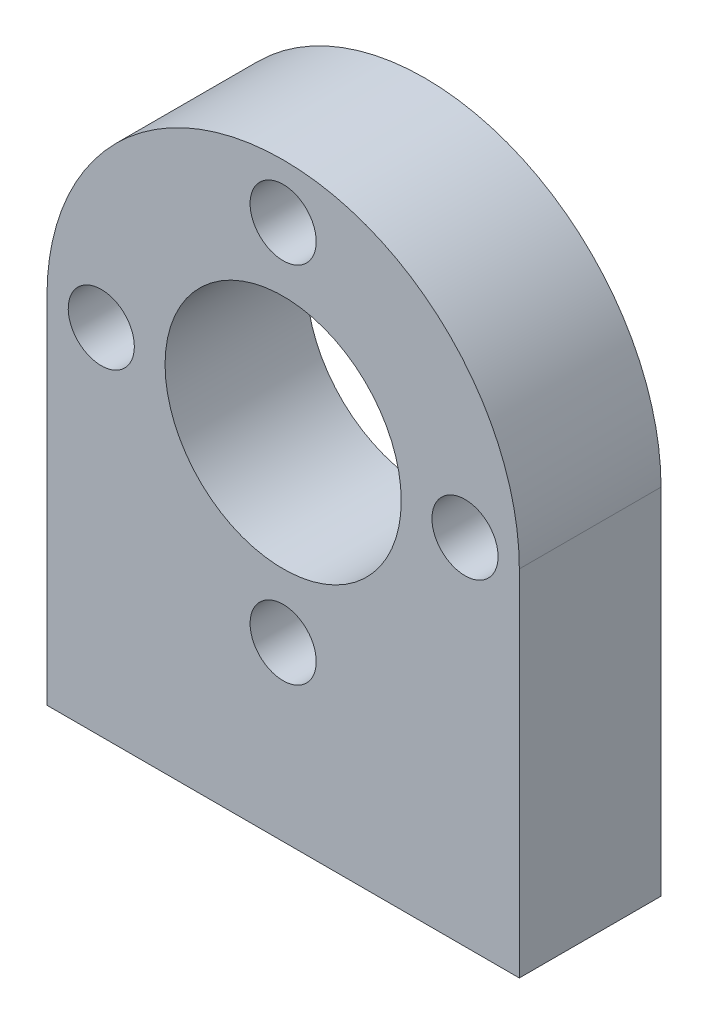
ISO-10303-21;
HEADER;
FILE_DESCRIPTION(('STEP AP214'),'2;1');
FILE_NAME('part.step','',(''),(''),'','','');
FILE_SCHEMA(('AUTOMOTIVE_DESIGN { 1 0 10303 214 1 1 1 1 }'));
ENDSEC;
DATA;
#1=APPLICATION_CONTEXT('core data for automotive mechanical design processes');
#2=APPLICATION_PROTOCOL_DEFINITION('international standard','automotive_design',2000,#1);
#3=PRODUCT_CONTEXT('',#1,'mechanical');
#4=PRODUCT('Part','Part','',(#3));
#5=PRODUCT_RELATED_PRODUCT_CATEGORY('part','',(#4));
#6=PRODUCT_DEFINITION_FORMATION('','',#4);
#7=PRODUCT_DEFINITION_CONTEXT('part definition',#1,'design');
#8=PRODUCT_DEFINITION('design','',#6,#7);
#9=PRODUCT_DEFINITION_SHAPE('','',#8);
#10=(LENGTH_UNIT() NAMED_UNIT(*) SI_UNIT(.MILLI.,.METRE.));
#11=(NAMED_UNIT(*) PLANE_ANGLE_UNIT() SI_UNIT($,.RADIAN.));
#12=(NAMED_UNIT(*) SI_UNIT($,.STERADIAN.) SOLID_ANGLE_UNIT());
#13=UNCERTAINTY_MEASURE_WITH_UNIT(LENGTH_MEASURE(1.E-05),#10,'distance_accuracy_value','');
#14=(GEOMETRIC_REPRESENTATION_CONTEXT(3) GLOBAL_UNCERTAINTY_ASSIGNED_CONTEXT((#13)) GLOBAL_UNIT_ASSIGNED_CONTEXT((#10,
#11,#12)) REPRESENTATION_CONTEXT('',''));
#15=CARTESIAN_POINT('',(0.,0.,0.));
#16=DIRECTION('',(0.,0.,1.));
#17=DIRECTION('',(1.,0.,0.));
#18=AXIS2_PLACEMENT_3D('',#15,#16,#17);
#19=CARTESIAN_POINT('',(0.,0.,7.62));
#20=DIRECTION('',(1.,0.,0.));
#21=DIRECTION('',(0.,0.,-1.));
#22=AXIS2_PLACEMENT_3D('',#19,#20,#21);
#23=PLANE('',#22);
#24=DIRECTION('',(0.,-1.,0.));
#25=VECTOR('',#24,1.);
#26=CARTESIAN_POINT('',(0.,0.,0.));
#27=LINE('',#26,#25);
#28=CARTESIAN_POINT('',(0.,-12.7,0.));
#29=VERTEX_POINT('',#28);
#30=CARTESIAN_POINT('',(0.,-31.75,0.));
#31=VERTEX_POINT('',#30);
#32=EDGE_CURVE('E98',#29,#31,#27,.T.);
#33=ORIENTED_EDGE('',*,*,#32,.F.);
#34=DIRECTION('',(0.,0.,-1.));
#35=VECTOR('',#34,1.);
#36=CARTESIAN_POINT('',(0.,-12.7,7.62));
#37=LINE('',#36,#35);
#38=CARTESIAN_POINT('',(0.,-12.7,7.62));
#39=VERTEX_POINT('',#38);
#40=EDGE_CURVE('E11',#39,#29,#37,.T.);
#41=ORIENTED_EDGE('',*,*,#40,.F.);
#42=DIRECTION('',(0.,-1.,0.));
#43=VECTOR('',#42,1.);
#44=CARTESIAN_POINT('',(0.,0.,7.62));
#45=LINE('',#44,#43);
#46=CARTESIAN_POINT('',(0.,-31.75,7.62));
#47=VERTEX_POINT('',#46);
#48=EDGE_CURVE('E83',#39,#47,#45,.T.);
#49=ORIENTED_EDGE('',*,*,#48,.T.);
#50=DIRECTION('',(0.,0.,-1.));
#51=VECTOR('',#50,1.);
#52=CARTESIAN_POINT('',(0.,-31.75,7.62));
#53=LINE('',#52,#51);
#54=EDGE_CURVE('E51',#47,#31,#53,.T.);
#55=ORIENTED_EDGE('',*,*,#54,.T.);
#56=EDGE_LOOP('',(#33,#41,#49,#55));
#57=FACE_BOUND('',#56,.T.);
#58=ADVANCED_FACE('F35',(#57),#23,.T.);
#59=CARTESIAN_POINT('',(-12.7,-12.7,7.62));
#60=DIRECTION('',(0.,0.,-1.));
#61=DIRECTION('',(-1.,0.,0.));
#62=AXIS2_PLACEMENT_3D('',#59,#60,#61);
#63=CYLINDRICAL_SURFACE('',#62,12.7);
#64=CARTESIAN_POINT('',(-12.7,-12.7,0.));
#65=DIRECTION('',(0.,0.,1.));
#66=DIRECTION('',(1.,0.,0.));
#67=AXIS2_PLACEMENT_3D('',#64,#65,#66);
#68=CIRCLE('',#67,12.7);
#69=CARTESIAN_POINT('',(-25.4,-12.7,0.));
#70=VERTEX_POINT('',#69);
#71=EDGE_CURVE('E89',#29,#70,#68,.T.);
#72=ORIENTED_EDGE('',*,*,#71,.T.);
#73=DIRECTION('',(0.,0.,-1.));
#74=VECTOR('',#73,1.);
#75=CARTESIAN_POINT('',(-25.4,-12.7,7.62));
#76=LINE('',#75,#74);
#77=CARTESIAN_POINT('',(-25.4,-12.7,7.62));
#78=VERTEX_POINT('',#77);
#79=EDGE_CURVE('E43',#78,#70,#76,.T.);
#80=ORIENTED_EDGE('',*,*,#79,.F.);
#81=CARTESIAN_POINT('',(-12.7,-12.7,7.62));
#82=DIRECTION('',(0.,0.,1.));
#83=DIRECTION('',(1.,0.,0.));
#84=AXIS2_PLACEMENT_3D('',#81,#82,#83);
#85=CIRCLE('',#84,12.7);
#86=EDGE_CURVE('E77',#39,#78,#85,.T.);
#87=ORIENTED_EDGE('',*,*,#86,.F.);
#88=ORIENTED_EDGE('',*,*,#40,.T.);
#89=EDGE_LOOP('',(#72,#80,#87,#88));
#90=FACE_BOUND('',#89,.T.);
#91=ADVANCED_FACE('F87',(#90),#63,.T.);
#92=CARTESIAN_POINT('',(-25.4,0.,7.62));
#93=DIRECTION('',(1.,0.,0.));
#94=DIRECTION('',(0.,1.,0.));
#95=AXIS2_PLACEMENT_3D('',#92,#93,#94);
#96=PLANE('',#95);
#97=DIRECTION('',(0.,-1.,0.));
#98=VECTOR('',#97,1.);
#99=CARTESIAN_POINT('',(-25.4,0.,0.));
#100=LINE('',#99,#98);
#101=CARTESIAN_POINT('',(-25.4,-31.75,0.));
#102=VERTEX_POINT('',#101);
#103=EDGE_CURVE('E102',#70,#102,#100,.T.);
#104=ORIENTED_EDGE('',*,*,#103,.T.);
#105=DIRECTION('',(0.,0.,-1.));
#106=VECTOR('',#105,1.);
#107=CARTESIAN_POINT('',(-25.4,-31.75,7.62));
#108=LINE('',#107,#106);
#109=CARTESIAN_POINT('',(-25.4,-31.75,7.62));
#110=VERTEX_POINT('',#109);
#111=EDGE_CURVE('E65',#110,#102,#108,.T.);
#112=ORIENTED_EDGE('',*,*,#111,.F.);
#113=DIRECTION('',(0.,-1.,0.));
#114=VECTOR('',#113,1.);
#115=CARTESIAN_POINT('',(-25.4,0.,7.62));
#116=LINE('',#115,#114);
#117=EDGE_CURVE('E82',#78,#110,#116,.T.);
#118=ORIENTED_EDGE('',*,*,#117,.F.);
#119=ORIENTED_EDGE('',*,*,#79,.T.);
#120=EDGE_LOOP('',(#104,#112,#118,#119));
#121=FACE_BOUND('',#120,.T.);
#122=ADVANCED_FACE('F92',(#121),#96,.F.);
#123=CARTESIAN_POINT('',(0.,-31.75,7.62));
#124=DIRECTION('',(0.,-1.,0.));
#125=DIRECTION('',(1.,0.,0.));
#126=AXIS2_PLACEMENT_3D('',#123,#124,#125);
#127=PLANE('',#126);
#128=DIRECTION('',(-1.,0.,0.));
#129=VECTOR('',#128,1.);
#130=CARTESIAN_POINT('',(0.,-31.75,0.));
#131=LINE('',#130,#129);
#132=EDGE_CURVE('E104',#31,#102,#131,.T.);
#133=ORIENTED_EDGE('',*,*,#132,.F.);
#134=ORIENTED_EDGE('',*,*,#54,.F.);
#135=DIRECTION('',(-1.,0.,0.));
#136=VECTOR('',#135,1.);
#137=CARTESIAN_POINT('',(0.,-31.75,7.62));
#138=LINE('',#137,#136);
#139=EDGE_CURVE('E93',#47,#110,#138,.T.);
#140=ORIENTED_EDGE('',*,*,#139,.T.);
#141=ORIENTED_EDGE('',*,*,#111,.T.);
#142=EDGE_LOOP('',(#133,#134,#140,#141));
#143=FACE_BOUND('',#142,.T.);
#144=ADVANCED_FACE('F152',(#143),#127,.T.);
#145=CARTESIAN_POINT('',(0.,0.,7.62));
#146=DIRECTION('',(0.,0.,1.));
#147=DIRECTION('',(1.,0.,0.));
#148=AXIS2_PLACEMENT_3D('',#145,#146,#147);
#149=PLANE('',#148);
#150=CARTESIAN_POINT('',(-22.479,-12.7,7.62));
#151=DIRECTION('',(0.,0.,1.));
#152=DIRECTION('',(0.,1.,0.));
#153=AXIS2_PLACEMENT_3D('',#150,#151,#152);
#154=CIRCLE('',#153,1.778);
#155=CARTESIAN_POINT('',(-22.479,-10.922,7.62));
#156=VERTEX_POINT('',#155);
#157=EDGE_CURVE('E134',#156,#156,#154,.T.);
#158=ORIENTED_EDGE('',*,*,#157,.F.);
#159=EDGE_LOOP('',(#158));
#160=FACE_BOUND('',#159,.T.);
#161=CARTESIAN_POINT('',(-12.7,-22.479,7.62));
#162=DIRECTION('',(0.,0.,1.));
#163=DIRECTION('',(-1.,0.,0.));
#164=AXIS2_PLACEMENT_3D('',#161,#162,#163);
#165=CIRCLE('',#164,1.778);
#166=CARTESIAN_POINT('',(-14.478,-22.479,7.62));
#167=VERTEX_POINT('',#166);
#168=EDGE_CURVE('E128',#167,#167,#165,.T.);
#169=ORIENTED_EDGE('',*,*,#168,.F.);
#170=EDGE_LOOP('',(#169));
#171=FACE_BOUND('',#170,.T.);
#172=CARTESIAN_POINT('',(-2.921,-12.6999999999999,7.62));
#173=DIRECTION('',(0.,0.,1.));
#174=DIRECTION('',(0.,-1.,0.));
#175=AXIS2_PLACEMENT_3D('',#172,#173,#174);
#176=CIRCLE('',#175,1.778);
#177=CARTESIAN_POINT('',(-2.92099999999998,-14.4779999999999,7.62));
#178=VERTEX_POINT('',#177);
#179=EDGE_CURVE('E122',#178,#178,#176,.T.);
#180=ORIENTED_EDGE('',*,*,#179,.F.);
#181=EDGE_LOOP('',(#180));
#182=FACE_BOUND('',#181,.T.);
#183=CARTESIAN_POINT('',(-12.7,-2.921,7.62));
#184=DIRECTION('',(0.,0.,1.));
#185=DIRECTION('',(1.,0.,0.));
#186=AXIS2_PLACEMENT_3D('',#183,#184,#185);
#187=CIRCLE('',#186,1.778);
#188=CARTESIAN_POINT('',(-10.922,-2.921,7.62));
#189=VERTEX_POINT('',#188);
#190=EDGE_CURVE('E116',#189,#189,#187,.T.);
#191=ORIENTED_EDGE('',*,*,#190,.F.);
#192=EDGE_LOOP('',(#191));
#193=FACE_BOUND('',#192,.T.);
#194=CARTESIAN_POINT('',(-12.7,-12.7,7.62));
#195=DIRECTION('',(0.,0.,1.));
#196=DIRECTION('',(1.,0.,0.));
#197=AXIS2_PLACEMENT_3D('',#194,#195,#196);
#198=CIRCLE('',#197,6.35);
#199=CARTESIAN_POINT('',(-6.35,-12.7,7.62));
#200=VERTEX_POINT('',#199);
#201=EDGE_CURVE('E110',#200,#200,#198,.T.);
#202=ORIENTED_EDGE('',*,*,#201,.F.);
#203=EDGE_LOOP('',(#202));
#204=FACE_BOUND('',#203,.T.);
#205=ORIENTED_EDGE('',*,*,#48,.F.);
#206=ORIENTED_EDGE('',*,*,#86,.T.);
#207=ORIENTED_EDGE('',*,*,#117,.T.);
#208=ORIENTED_EDGE('',*,*,#139,.F.);
#209=EDGE_LOOP('',(#205,#206,#207,#208));
#210=FACE_BOUND('',#209,.T.);
#211=ADVANCED_FACE('F79',(#160,#171,#182,#193,#204,#210),#149,.T.);
#212=CARTESIAN_POINT('',(0.,0.,0.));
#213=DIRECTION('',(0.,0.,1.));
#214=DIRECTION('',(1.,0.,0.));
#215=AXIS2_PLACEMENT_3D('',#212,#213,#214);
#216=PLANE('',#215);
#217=CARTESIAN_POINT('',(-22.479,-12.7,0.));
#218=DIRECTION('',(0.,0.,1.));
#219=DIRECTION('',(0.,1.,0.));
#220=AXIS2_PLACEMENT_3D('',#217,#218,#219);
#221=CIRCLE('',#220,1.778);
#222=CARTESIAN_POINT('',(-22.479,-10.922,0.));
#223=VERTEX_POINT('',#222);
#224=EDGE_CURVE('E119',#223,#223,#221,.T.);
#225=ORIENTED_EDGE('',*,*,#224,.T.);
#226=EDGE_LOOP('',(#225));
#227=FACE_BOUND('',#226,.T.);
#228=CARTESIAN_POINT('',(-12.7,-22.479,0.));
#229=DIRECTION('',(0.,0.,1.));
#230=DIRECTION('',(-1.,0.,0.));
#231=AXIS2_PLACEMENT_3D('',#228,#229,#230);
#232=CIRCLE('',#231,1.778);
#233=CARTESIAN_POINT('',(-14.478,-22.479,0.));
#234=VERTEX_POINT('',#233);
#235=EDGE_CURVE('E131',#234,#234,#232,.T.);
#236=ORIENTED_EDGE('',*,*,#235,.T.);
#237=EDGE_LOOP('',(#236));
#238=FACE_BOUND('',#237,.T.);
#239=CARTESIAN_POINT('',(-2.921,-12.6999999999999,0.));
#240=DIRECTION('',(0.,0.,1.));
#241=DIRECTION('',(0.,-1.,0.));
#242=AXIS2_PLACEMENT_3D('',#239,#240,#241);
#243=CIRCLE('',#242,1.778);
#244=CARTESIAN_POINT('',(-2.92099999999998,-14.4779999999999,0.));
#245=VERTEX_POINT('',#244);
#246=EDGE_CURVE('E125',#245,#245,#243,.T.);
#247=ORIENTED_EDGE('',*,*,#246,.T.);
#248=EDGE_LOOP('',(#247));
#249=FACE_BOUND('',#248,.T.);
#250=CARTESIAN_POINT('',(-12.7,-2.921,0.));
#251=DIRECTION('',(0.,0.,1.));
#252=DIRECTION('',(1.,0.,0.));
#253=AXIS2_PLACEMENT_3D('',#250,#251,#252);
#254=CIRCLE('',#253,1.778);
#255=CARTESIAN_POINT('',(-10.922,-2.921,0.));
#256=VERTEX_POINT('',#255);
#257=EDGE_CURVE('E113',#256,#256,#254,.T.);
#258=ORIENTED_EDGE('',*,*,#257,.T.);
#259=EDGE_LOOP('',(#258));
#260=FACE_BOUND('',#259,.T.);
#261=CARTESIAN_POINT('',(-12.7,-12.7,0.));
#262=DIRECTION('',(0.,0.,1.));
#263=DIRECTION('',(1.,0.,0.));
#264=AXIS2_PLACEMENT_3D('',#261,#262,#263);
#265=CIRCLE('',#264,6.35);
#266=CARTESIAN_POINT('',(-6.35,-12.7,0.));
#267=VERTEX_POINT('',#266);
#268=EDGE_CURVE('E100',#267,#267,#265,.T.);
#269=ORIENTED_EDGE('',*,*,#268,.T.);
#270=EDGE_LOOP('',(#269));
#271=FACE_BOUND('',#270,.T.);
#272=ORIENTED_EDGE('',*,*,#32,.T.);
#273=ORIENTED_EDGE('',*,*,#132,.T.);
#274=ORIENTED_EDGE('',*,*,#103,.F.);
#275=ORIENTED_EDGE('',*,*,#71,.F.);
#276=EDGE_LOOP('',(#272,#273,#274,#275));
#277=FACE_BOUND('',#276,.T.);
#278=ADVANCED_FACE('F140',(#227,#238,#249,#260,#271,#277),#216,.F.);
#279=CARTESIAN_POINT('',(-12.7,-12.7,0.));
#280=DIRECTION('',(0.,0.,1.));
#281=DIRECTION('',(1.,0.,0.));
#282=AXIS2_PLACEMENT_3D('',#279,#280,#281);
#283=CYLINDRICAL_SURFACE('',#282,6.35);
#284=ORIENTED_EDGE('',*,*,#268,.F.);
#285=EDGE_LOOP('',(#284));
#286=FACE_BOUND('',#285,.T.);
#287=ORIENTED_EDGE('',*,*,#201,.T.);
#288=EDGE_LOOP('',(#287));
#289=FACE_BOUND('',#288,.T.);
#290=ADVANCED_FACE('F162',(#286,#289),#283,.F.);
#291=CARTESIAN_POINT('',(-12.7,-2.921,0.));
#292=DIRECTION('',(0.,0.,1.));
#293=DIRECTION('',(1.,0.,0.));
#294=AXIS2_PLACEMENT_3D('',#291,#292,#293);
#295=CYLINDRICAL_SURFACE('',#294,1.778);
#296=ORIENTED_EDGE('',*,*,#257,.F.);
#297=EDGE_LOOP('',(#296));
#298=FACE_BOUND('',#297,.T.);
#299=ORIENTED_EDGE('',*,*,#190,.T.);
#300=EDGE_LOOP('',(#299));
#301=FACE_BOUND('',#300,.T.);
#302=ADVANCED_FACE('F164',(#298,#301),#295,.F.);
#303=CARTESIAN_POINT('',(-2.921,-12.6999999999999,0.));
#304=DIRECTION('',(0.,0.,1.));
#305=DIRECTION('',(1.,0.,0.));
#306=AXIS2_PLACEMENT_3D('',#303,#304,#305);
#307=CYLINDRICAL_SURFACE('',#306,1.778);
#308=ORIENTED_EDGE('',*,*,#246,.F.);
#309=EDGE_LOOP('',(#308));
#310=FACE_BOUND('',#309,.T.);
#311=ORIENTED_EDGE('',*,*,#179,.T.);
#312=EDGE_LOOP('',(#311));
#313=FACE_BOUND('',#312,.T.);
#314=ADVANCED_FACE('F171',(#310,#313),#307,.F.);
#315=CARTESIAN_POINT('',(-12.7,-22.479,0.));
#316=DIRECTION('',(0.,0.,1.));
#317=DIRECTION('',(1.,0.,0.));
#318=AXIS2_PLACEMENT_3D('',#315,#316,#317);
#319=CYLINDRICAL_SURFACE('',#318,1.778);
#320=ORIENTED_EDGE('',*,*,#235,.F.);
#321=EDGE_LOOP('',(#320));
#322=FACE_BOUND('',#321,.T.);
#323=ORIENTED_EDGE('',*,*,#168,.T.);
#324=EDGE_LOOP('',(#323));
#325=FACE_BOUND('',#324,.T.);
#326=ADVANCED_FACE('F146',(#322,#325),#319,.F.);
#327=CARTESIAN_POINT('',(-22.479,-12.7,0.));
#328=DIRECTION('',(0.,0.,1.));
#329=DIRECTION('',(1.,0.,0.));
#330=AXIS2_PLACEMENT_3D('',#327,#328,#329);
#331=CYLINDRICAL_SURFACE('',#330,1.778);
#332=ORIENTED_EDGE('',*,*,#224,.F.);
#333=EDGE_LOOP('',(#332));
#334=FACE_BOUND('',#333,.T.);
#335=ORIENTED_EDGE('',*,*,#157,.T.);
#336=EDGE_LOOP('',(#335));
#337=FACE_BOUND('',#336,.T.);
#338=ADVANCED_FACE('F143',(#334,#337),#331,.F.);
#339=CLOSED_SHELL('',(#58,#91,#122,#144,#211,#278,#290,#302,#314,#326,#338));
#340=MANIFOLD_SOLID_BREP('B2',#339);
#341=ADVANCED_BREP_SHAPE_REPRESENTATION('',(#18,#340),#14);
#342=SHAPE_DEFINITION_REPRESENTATION(#9,#341);
ENDSEC;
END-ISO-10303-21;
